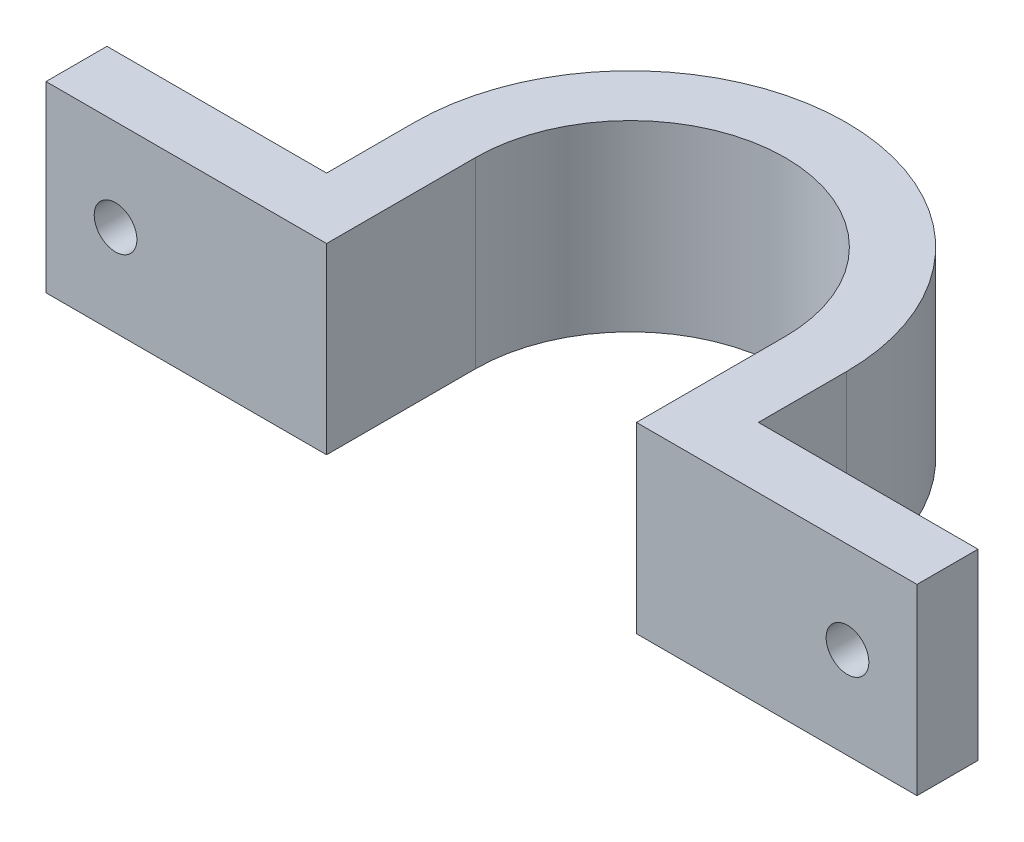
ISO-10303-21;
HEADER;
FILE_DESCRIPTION(('STEP AP214'),'2;1');
FILE_NAME('part.step','',(''),(''),'','','');
FILE_SCHEMA(('AUTOMOTIVE_DESIGN { 1 0 10303 214 1 1 1 1 }'));
ENDSEC;
DATA;
#1=APPLICATION_CONTEXT('core data for automotive mechanical design processes');
#2=APPLICATION_PROTOCOL_DEFINITION('international standard','automotive_design',2000,#1);
#3=PRODUCT_CONTEXT('',#1,'mechanical');
#4=PRODUCT('Part','Part','',(#3));
#5=PRODUCT_RELATED_PRODUCT_CATEGORY('part','',(#4));
#6=PRODUCT_DEFINITION_FORMATION('','',#4);
#7=PRODUCT_DEFINITION_CONTEXT('part definition',#1,'design');
#8=PRODUCT_DEFINITION('design','',#6,#7);
#9=PRODUCT_DEFINITION_SHAPE('','',#8);
#10=(LENGTH_UNIT() NAMED_UNIT(*) SI_UNIT(.MILLI.,.METRE.));
#11=(NAMED_UNIT(*) PLANE_ANGLE_UNIT() SI_UNIT($,.RADIAN.));
#12=(NAMED_UNIT(*) SI_UNIT($,.STERADIAN.) SOLID_ANGLE_UNIT());
#13=UNCERTAINTY_MEASURE_WITH_UNIT(LENGTH_MEASURE(1.E-05),#10,'distance_accuracy_value','');
#14=(GEOMETRIC_REPRESENTATION_CONTEXT(3) GLOBAL_UNCERTAINTY_ASSIGNED_CONTEXT((#13)) GLOBAL_UNIT_ASSIGNED_CONTEXT((#10,
#11,#12)) REPRESENTATION_CONTEXT('',''));
#15=CARTESIAN_POINT('',(0.,0.,0.));
#16=DIRECTION('',(0.,0.,1.));
#17=DIRECTION('',(1.,0.,0.));
#18=AXIS2_PLACEMENT_3D('',#15,#16,#17);
#19=CARTESIAN_POINT('',(17.7,15.,7.19999999999999));
#20=DIRECTION('',(0.,0.,1.));
#21=DIRECTION('',(1.,0.,0.));
#22=AXIS2_PLACEMENT_3D('',#19,#20,#21);
#23=PLANE('',#22);
#24=CARTESIAN_POINT('',(30.,7.5,7.19999999999999));
#25=DIRECTION('',(0.,0.,-1.));
#26=DIRECTION('',(-1.,0.,0.));
#27=AXIS2_PLACEMENT_3D('',#24,#25,#26);
#28=CIRCLE('',#27,1.75);
#29=CARTESIAN_POINT('',(28.25,7.5,7.19999999999999));
#30=VERTEX_POINT('',#29);
#31=EDGE_CURVE('E271',#30,#30,#28,.T.);
#32=ORIENTED_EDGE('',*,*,#31,.F.);
#33=EDGE_LOOP('',(#32));
#34=FACE_BOUND('',#33,.T.);
#35=DIRECTION('',(-1.,0.,0.));
#36=VECTOR('',#35,1.);
#37=CARTESIAN_POINT('',(17.7,0.,7.19999999999999));
#38=LINE('',#37,#36);
#39=CARTESIAN_POINT('',(35.7,0.,7.2));
#40=VERTEX_POINT('',#39);
#41=CARTESIAN_POINT('',(17.7,0.,7.19999999999999));
#42=VERTEX_POINT('',#41);
#43=EDGE_CURVE('E159',#40,#42,#38,.T.);
#44=ORIENTED_EDGE('',*,*,#43,.T.);
#45=DIRECTION('',(0.,-1.,0.));
#46=VECTOR('',#45,1.);
#47=CARTESIAN_POINT('',(17.7,15.,7.19999999999999));
#48=LINE('',#47,#46);
#49=CARTESIAN_POINT('',(17.7,15.,7.19999999999999));
#50=VERTEX_POINT('',#49);
#51=EDGE_CURVE('E11',#50,#42,#48,.T.);
#52=ORIENTED_EDGE('',*,*,#51,.F.);
#53=DIRECTION('',(-1.,0.,0.));
#54=VECTOR('',#53,1.);
#55=CARTESIAN_POINT('',(17.7,15.,7.19999999999999));
#56=LINE('',#55,#54);
#57=CARTESIAN_POINT('',(35.7,15.,7.2));
#58=VERTEX_POINT('',#57);
#59=EDGE_CURVE('E182',#58,#50,#56,.T.);
#60=ORIENTED_EDGE('',*,*,#59,.F.);
#61=DIRECTION('',(0.,-1.,0.));
#62=VECTOR('',#61,1.);
#63=CARTESIAN_POINT('',(35.7,15.,7.2));
#64=LINE('',#63,#62);
#65=EDGE_CURVE('E155',#58,#40,#64,.T.);
#66=ORIENTED_EDGE('',*,*,#65,.T.);
#67=EDGE_LOOP('',(#44,#52,#60,#66));
#68=FACE_BOUND('',#67,.T.);
#69=ADVANCED_FACE('F39',(#34,#68),#23,.F.);
#70=CARTESIAN_POINT('',(17.7,15.,0.));
#71=DIRECTION('',(-1.,0.,0.));
#72=DIRECTION('',(0.,0.,1.));
#73=AXIS2_PLACEMENT_3D('',#70,#71,#72);
#74=PLANE('',#73);
#75=DIRECTION('',(0.,0.,-1.));
#76=VECTOR('',#75,1.);
#77=CARTESIAN_POINT('',(17.7,0.,0.));
#78=LINE('',#77,#76);
#79=CARTESIAN_POINT('',(17.7,0.,0.));
#80=VERTEX_POINT('',#79);
#81=EDGE_CURVE('E162',#42,#80,#78,.T.);
#82=ORIENTED_EDGE('',*,*,#81,.T.);
#83=DIRECTION('',(0.,-1.,0.));
#84=VECTOR('',#83,1.);
#85=CARTESIAN_POINT('',(17.7,15.,0.));
#86=LINE('',#85,#84);
#87=CARTESIAN_POINT('',(17.7,15.,0.));
#88=VERTEX_POINT('',#87);
#89=EDGE_CURVE('E47',#88,#80,#86,.T.);
#90=ORIENTED_EDGE('',*,*,#89,.F.);
#91=DIRECTION('',(0.,0.,-1.));
#92=VECTOR('',#91,1.);
#93=CARTESIAN_POINT('',(17.7,15.,0.));
#94=LINE('',#93,#92);
#95=EDGE_CURVE('E110',#50,#88,#94,.T.);
#96=ORIENTED_EDGE('',*,*,#95,.F.);
#97=ORIENTED_EDGE('',*,*,#51,.T.);
#98=EDGE_LOOP('',(#82,#90,#96,#97));
#99=FACE_BOUND('',#98,.T.);
#100=ADVANCED_FACE('F262',(#99),#74,.F.);
#101=CARTESIAN_POINT('',(0.,15.,0.));
#102=DIRECTION('',(0.,-1.,0.));
#103=DIRECTION('',(0.,0.,-1.));
#104=AXIS2_PLACEMENT_3D('',#101,#102,#103);
#105=CYLINDRICAL_SURFACE('',#104,17.7);
#106=CARTESIAN_POINT('',(0.,0.,0.));
#107=DIRECTION('',(0.,1.,0.));
#108=DIRECTION('',(0.,0.,1.));
#109=AXIS2_PLACEMENT_3D('',#106,#107,#108);
#110=CIRCLE('',#109,17.7);
#111=CARTESIAN_POINT('',(-17.7,0.,0.));
#112=VERTEX_POINT('',#111);
#113=EDGE_CURVE('E165',#80,#112,#110,.T.);
#114=ORIENTED_EDGE('',*,*,#113,.T.);
#115=DIRECTION('',(0.,-1.,0.));
#116=VECTOR('',#115,1.);
#117=CARTESIAN_POINT('',(-17.7,15.,0.));
#118=LINE('',#117,#116);
#119=CARTESIAN_POINT('',(-17.7,15.,0.));
#120=VERTEX_POINT('',#119);
#121=EDGE_CURVE('E201',#120,#112,#118,.T.);
#122=ORIENTED_EDGE('',*,*,#121,.F.);
#123=CARTESIAN_POINT('',(0.,15.,0.));
#124=DIRECTION('',(0.,1.,0.));
#125=DIRECTION('',(0.,0.,1.));
#126=AXIS2_PLACEMENT_3D('',#123,#124,#125);
#127=CIRCLE('',#126,17.7);
#128=EDGE_CURVE('E209',#88,#120,#127,.T.);
#129=ORIENTED_EDGE('',*,*,#128,.F.);
#130=ORIENTED_EDGE('',*,*,#89,.T.);
#131=EDGE_LOOP('',(#114,#122,#129,#130));
#132=FACE_BOUND('',#131,.T.);
#133=ADVANCED_FACE('F207',(#132),#105,.T.);
#134=CARTESIAN_POINT('',(-17.7,15.,0.));
#135=DIRECTION('',(1.,0.,0.));
#136=DIRECTION('',(0.,0.,-1.));
#137=AXIS2_PLACEMENT_3D('',#134,#135,#136);
#138=PLANE('',#137);
#139=DIRECTION('',(0.,0.,1.));
#140=VECTOR('',#139,1.);
#141=CARTESIAN_POINT('',(-17.7,0.,0.));
#142=LINE('',#141,#140);
#143=CARTESIAN_POINT('',(-17.7,0.,7.19999999999999));
#144=VERTEX_POINT('',#143);
#145=EDGE_CURVE('E167',#112,#144,#142,.T.);
#146=ORIENTED_EDGE('',*,*,#145,.T.);
#147=DIRECTION('',(0.,-1.,0.));
#148=VECTOR('',#147,1.);
#149=CARTESIAN_POINT('',(-17.7,15.,7.19999999999999));
#150=LINE('',#149,#148);
#151=CARTESIAN_POINT('',(-17.7,15.,7.19999999999999));
#152=VERTEX_POINT('',#151);
#153=EDGE_CURVE('E198',#152,#144,#150,.T.);
#154=ORIENTED_EDGE('',*,*,#153,.F.);
#155=DIRECTION('',(0.,0.,1.));
#156=VECTOR('',#155,1.);
#157=CARTESIAN_POINT('',(-17.7,15.,0.));
#158=LINE('',#157,#156);
#159=EDGE_CURVE('E227',#120,#152,#158,.T.);
#160=ORIENTED_EDGE('',*,*,#159,.F.);
#161=ORIENTED_EDGE('',*,*,#121,.T.);
#162=EDGE_LOOP('',(#146,#154,#160,#161));
#163=FACE_BOUND('',#162,.T.);
#164=ADVANCED_FACE('F218',(#163),#138,.F.);
#165=CARTESIAN_POINT('',(-17.7,15.,7.19999999999999));
#166=DIRECTION('',(0.,0.,1.));
#167=DIRECTION('',(1.,0.,0.));
#168=AXIS2_PLACEMENT_3D('',#165,#166,#167);
#169=PLANE('',#168);
#170=CARTESIAN_POINT('',(-30.,7.5,7.19999999999999));
#171=DIRECTION('',(0.,0.,-1.));
#172=DIRECTION('',(-1.,0.,0.));
#173=AXIS2_PLACEMENT_3D('',#170,#171,#172);
#174=CIRCLE('',#173,1.75);
#175=CARTESIAN_POINT('',(-31.75,7.5,7.19999999999999));
#176=VERTEX_POINT('',#175);
#177=EDGE_CURVE('E273',#176,#176,#174,.T.);
#178=ORIENTED_EDGE('',*,*,#177,.F.);
#179=EDGE_LOOP('',(#178));
#180=FACE_BOUND('',#179,.T.);
#181=DIRECTION('',(-1.,0.,0.));
#182=VECTOR('',#181,1.);
#183=CARTESIAN_POINT('',(-17.7,0.,7.19999999999999));
#184=LINE('',#183,#182);
#185=CARTESIAN_POINT('',(-35.7,0.,7.2));
#186=VERTEX_POINT('',#185);
#187=EDGE_CURVE('E169',#144,#186,#184,.T.);
#188=ORIENTED_EDGE('',*,*,#187,.T.);
#189=DIRECTION('',(0.,-1.,0.));
#190=VECTOR('',#189,1.);
#191=CARTESIAN_POINT('',(-35.7,15.,7.2));
#192=LINE('',#191,#190);
#193=CARTESIAN_POINT('',(-35.7,15.,7.2));
#194=VERTEX_POINT('',#193);
#195=EDGE_CURVE('E195',#194,#186,#192,.T.);
#196=ORIENTED_EDGE('',*,*,#195,.F.);
#197=DIRECTION('',(-1.,0.,0.));
#198=VECTOR('',#197,1.);
#199=CARTESIAN_POINT('',(-17.7,15.,7.19999999999999));
#200=LINE('',#199,#198);
#201=EDGE_CURVE('E224',#152,#194,#200,.T.);
#202=ORIENTED_EDGE('',*,*,#201,.F.);
#203=ORIENTED_EDGE('',*,*,#153,.T.);
#204=EDGE_LOOP('',(#188,#196,#202,#203));
#205=FACE_BOUND('',#204,.T.);
#206=ADVANCED_FACE('F222',(#180,#205),#169,.F.);
#207=CARTESIAN_POINT('',(-35.7,15.,7.2));
#208=DIRECTION('',(1.,0.,0.));
#209=DIRECTION('',(0.,0.,-1.));
#210=AXIS2_PLACEMENT_3D('',#207,#208,#209);
#211=PLANE('',#210);
#212=DIRECTION('',(0.,0.,1.));
#213=VECTOR('',#212,1.);
#214=CARTESIAN_POINT('',(-35.7,0.,7.2));
#215=LINE('',#214,#213);
#216=CARTESIAN_POINT('',(-35.7,0.,12.2));
#217=VERTEX_POINT('',#216);
#218=EDGE_CURVE('E171',#186,#217,#215,.T.);
#219=ORIENTED_EDGE('',*,*,#218,.T.);
#220=DIRECTION('',(0.,-1.,0.));
#221=VECTOR('',#220,1.);
#222=CARTESIAN_POINT('',(-35.7,15.,12.2));
#223=LINE('',#222,#221);
#224=CARTESIAN_POINT('',(-35.7,15.,12.2));
#225=VERTEX_POINT('',#224);
#226=EDGE_CURVE('E192',#225,#217,#223,.T.);
#227=ORIENTED_EDGE('',*,*,#226,.F.);
#228=DIRECTION('',(0.,0.,1.));
#229=VECTOR('',#228,1.);
#230=CARTESIAN_POINT('',(-35.7,15.,7.2));
#231=LINE('',#230,#229);
#232=EDGE_CURVE('E226',#194,#225,#231,.T.);
#233=ORIENTED_EDGE('',*,*,#232,.F.);
#234=ORIENTED_EDGE('',*,*,#195,.T.);
#235=EDGE_LOOP('',(#219,#227,#233,#234));
#236=FACE_BOUND('',#235,.T.);
#237=ADVANCED_FACE('F296',(#236),#211,.F.);
#238=CARTESIAN_POINT('',(-35.7,15.,12.2));
#239=DIRECTION('',(0.,0.,-1.));
#240=DIRECTION('',(-1.,0.,0.));
#241=AXIS2_PLACEMENT_3D('',#238,#239,#240);
#242=PLANE('',#241);
#243=CARTESIAN_POINT('',(-30.,7.5,12.2));
#244=DIRECTION('',(0.,0.,-1.));
#245=DIRECTION('',(-1.,0.,0.));
#246=AXIS2_PLACEMENT_3D('',#243,#244,#245);
#247=CIRCLE('',#246,1.75);
#248=CARTESIAN_POINT('',(-31.75,7.5,12.2));
#249=VERTEX_POINT('',#248);
#250=EDGE_CURVE('E278',#249,#249,#247,.T.);
#251=ORIENTED_EDGE('',*,*,#250,.T.);
#252=EDGE_LOOP('',(#251));
#253=FACE_BOUND('',#252,.T.);
#254=DIRECTION('',(1.,0.,0.));
#255=VECTOR('',#254,1.);
#256=CARTESIAN_POINT('',(-35.7,0.,12.2));
#257=LINE('',#256,#255);
#258=CARTESIAN_POINT('',(-12.7,0.,12.2));
#259=VERTEX_POINT('',#258);
#260=EDGE_CURVE('E173',#217,#259,#257,.T.);
#261=ORIENTED_EDGE('',*,*,#260,.T.);
#262=DIRECTION('',(0.,-1.,0.));
#263=VECTOR('',#262,1.);
#264=CARTESIAN_POINT('',(-12.7,15.,12.2));
#265=LINE('',#264,#263);
#266=CARTESIAN_POINT('',(-12.7,15.,12.2));
#267=VERTEX_POINT('',#266);
#268=EDGE_CURVE('E189',#267,#259,#265,.T.);
#269=ORIENTED_EDGE('',*,*,#268,.F.);
#270=DIRECTION('',(1.,0.,0.));
#271=VECTOR('',#270,1.);
#272=CARTESIAN_POINT('',(-35.7,15.,12.2));
#273=LINE('',#272,#271);
#274=EDGE_CURVE('E229',#225,#267,#273,.T.);
#275=ORIENTED_EDGE('',*,*,#274,.F.);
#276=ORIENTED_EDGE('',*,*,#226,.T.);
#277=EDGE_LOOP('',(#261,#269,#275,#276));
#278=FACE_BOUND('',#277,.T.);
#279=ADVANCED_FACE('F286',(#253,#278),#242,.F.);
#280=CARTESIAN_POINT('',(-12.7,15.,12.2));
#281=DIRECTION('',(-1.,0.,0.));
#282=DIRECTION('',(0.,0.,1.));
#283=AXIS2_PLACEMENT_3D('',#280,#281,#282);
#284=PLANE('',#283);
#285=DIRECTION('',(0.,0.,-1.));
#286=VECTOR('',#285,1.);
#287=CARTESIAN_POINT('',(-12.7,0.,12.2));
#288=LINE('',#287,#286);
#289=CARTESIAN_POINT('',(-12.7,0.,0.));
#290=VERTEX_POINT('',#289);
#291=EDGE_CURVE('E175',#259,#290,#288,.T.);
#292=ORIENTED_EDGE('',*,*,#291,.T.);
#293=DIRECTION('',(0.,-1.,0.));
#294=VECTOR('',#293,1.);
#295=CARTESIAN_POINT('',(-12.7,15.,0.));
#296=LINE('',#295,#294);
#297=CARTESIAN_POINT('',(-12.7,15.,0.));
#298=VERTEX_POINT('',#297);
#299=EDGE_CURVE('E186',#298,#290,#296,.T.);
#300=ORIENTED_EDGE('',*,*,#299,.F.);
#301=DIRECTION('',(0.,0.,-1.));
#302=VECTOR('',#301,1.);
#303=CARTESIAN_POINT('',(-12.7,15.,12.2));
#304=LINE('',#303,#302);
#305=EDGE_CURVE('E235',#267,#298,#304,.T.);
#306=ORIENTED_EDGE('',*,*,#305,.F.);
#307=ORIENTED_EDGE('',*,*,#268,.T.);
#308=EDGE_LOOP('',(#292,#300,#306,#307));
#309=FACE_BOUND('',#308,.T.);
#310=ADVANCED_FACE('F241',(#309),#284,.F.);
#311=CARTESIAN_POINT('',(0.,15.,0.));
#312=DIRECTION('',(0.,-1.,0.));
#313=DIRECTION('',(0.,0.,-1.));
#314=AXIS2_PLACEMENT_3D('',#311,#312,#313);
#315=CYLINDRICAL_SURFACE('',#314,12.7);
#316=CARTESIAN_POINT('',(0.,0.,0.));
#317=DIRECTION('',(0.,-1.,0.));
#318=DIRECTION('',(0.,0.,-1.));
#319=AXIS2_PLACEMENT_3D('',#316,#317,#318);
#320=CIRCLE('',#319,12.7);
#321=CARTESIAN_POINT('',(12.7,0.,0.));
#322=VERTEX_POINT('',#321);
#323=EDGE_CURVE('E177',#290,#322,#320,.T.);
#324=ORIENTED_EDGE('',*,*,#323,.T.);
#325=DIRECTION('',(0.,-1.,0.));
#326=VECTOR('',#325,1.);
#327=CARTESIAN_POINT('',(12.7,15.,0.));
#328=LINE('',#327,#326);
#329=CARTESIAN_POINT('',(12.7,15.,0.));
#330=VERTEX_POINT('',#329);
#331=EDGE_CURVE('E150',#330,#322,#328,.T.);
#332=ORIENTED_EDGE('',*,*,#331,.F.);
#333=CARTESIAN_POINT('',(0.,15.,0.));
#334=DIRECTION('',(0.,-1.,0.));
#335=DIRECTION('',(0.,0.,-1.));
#336=AXIS2_PLACEMENT_3D('',#333,#334,#335);
#337=CIRCLE('',#336,12.7);
#338=EDGE_CURVE('E141',#298,#330,#337,.T.);
#339=ORIENTED_EDGE('',*,*,#338,.F.);
#340=ORIENTED_EDGE('',*,*,#299,.T.);
#341=EDGE_LOOP('',(#324,#332,#339,#340));
#342=FACE_BOUND('',#341,.T.);
#343=ADVANCED_FACE('F245',(#342),#315,.F.);
#344=CARTESIAN_POINT('',(12.7,15.,12.2));
#345=DIRECTION('',(1.,0.,0.));
#346=DIRECTION('',(0.,0.,-1.));
#347=AXIS2_PLACEMENT_3D('',#344,#345,#346);
#348=PLANE('',#347);
#349=DIRECTION('',(0.,0.,1.));
#350=VECTOR('',#349,1.);
#351=CARTESIAN_POINT('',(12.7,0.,12.2));
#352=LINE('',#351,#350);
#353=CARTESIAN_POINT('',(12.7,0.,12.2));
#354=VERTEX_POINT('',#353);
#355=EDGE_CURVE('E149',#322,#354,#352,.T.);
#356=ORIENTED_EDGE('',*,*,#355,.T.);
#357=DIRECTION('',(0.,-1.,0.));
#358=VECTOR('',#357,1.);
#359=CARTESIAN_POINT('',(12.7,15.,12.2));
#360=LINE('',#359,#358);
#361=CARTESIAN_POINT('',(12.7,15.,12.2));
#362=VERTEX_POINT('',#361);
#363=EDGE_CURVE('E146',#362,#354,#360,.T.);
#364=ORIENTED_EDGE('',*,*,#363,.F.);
#365=DIRECTION('',(0.,0.,1.));
#366=VECTOR('',#365,1.);
#367=CARTESIAN_POINT('',(12.7,15.,12.2));
#368=LINE('',#367,#366);
#369=EDGE_CURVE('E135',#330,#362,#368,.T.);
#370=ORIENTED_EDGE('',*,*,#369,.F.);
#371=ORIENTED_EDGE('',*,*,#331,.T.);
#372=EDGE_LOOP('',(#356,#364,#370,#371));
#373=FACE_BOUND('',#372,.T.);
#374=ADVANCED_FACE('F147',(#373),#348,.F.);
#375=CARTESIAN_POINT('',(35.7,15.,12.2));
#376=DIRECTION('',(0.,0.,-1.));
#377=DIRECTION('',(-1.,0.,0.));
#378=AXIS2_PLACEMENT_3D('',#375,#376,#377);
#379=PLANE('',#378);
#380=CARTESIAN_POINT('',(30.,7.5,12.2));
#381=DIRECTION('',(0.,0.,-1.));
#382=DIRECTION('',(-1.,0.,0.));
#383=AXIS2_PLACEMENT_3D('',#380,#381,#382);
#384=CIRCLE('',#383,1.75);
#385=CARTESIAN_POINT('',(28.25,7.5,12.2));
#386=VERTEX_POINT('',#385);
#387=EDGE_CURVE('E163',#386,#386,#384,.T.);
#388=ORIENTED_EDGE('',*,*,#387,.T.);
#389=EDGE_LOOP('',(#388));
#390=FACE_BOUND('',#389,.T.);
#391=DIRECTION('',(1.,0.,0.));
#392=VECTOR('',#391,1.);
#393=CARTESIAN_POINT('',(35.7,0.,12.2));
#394=LINE('',#393,#392);
#395=CARTESIAN_POINT('',(35.7,0.,12.2));
#396=VERTEX_POINT('',#395);
#397=EDGE_CURVE('E96',#354,#396,#394,.T.);
#398=ORIENTED_EDGE('',*,*,#397,.T.);
#399=DIRECTION('',(0.,-1.,0.));
#400=VECTOR('',#399,1.);
#401=CARTESIAN_POINT('',(35.7,15.,12.2));
#402=LINE('',#401,#400);
#403=CARTESIAN_POINT('',(35.7,15.,12.2));
#404=VERTEX_POINT('',#403);
#405=EDGE_CURVE('E151',#404,#396,#402,.T.);
#406=ORIENTED_EDGE('',*,*,#405,.F.);
#407=DIRECTION('',(1.,0.,0.));
#408=VECTOR('',#407,1.);
#409=CARTESIAN_POINT('',(35.7,15.,12.2));
#410=LINE('',#409,#408);
#411=EDGE_CURVE('E139',#362,#404,#410,.T.);
#412=ORIENTED_EDGE('',*,*,#411,.F.);
#413=ORIENTED_EDGE('',*,*,#363,.T.);
#414=EDGE_LOOP('',(#398,#406,#412,#413));
#415=FACE_BOUND('',#414,.T.);
#416=ADVANCED_FACE('F153',(#390,#415),#379,.F.);
#417=CARTESIAN_POINT('',(35.7,15.,7.2));
#418=DIRECTION('',(-1.,0.,0.));
#419=DIRECTION('',(0.,0.,1.));
#420=AXIS2_PLACEMENT_3D('',#417,#418,#419);
#421=PLANE('',#420);
#422=DIRECTION('',(0.,0.,-1.));
#423=VECTOR('',#422,1.);
#424=CARTESIAN_POINT('',(35.7,0.,7.2));
#425=LINE('',#424,#423);
#426=EDGE_CURVE('E102',#396,#40,#425,.T.);
#427=ORIENTED_EDGE('',*,*,#426,.T.);
#428=ORIENTED_EDGE('',*,*,#65,.F.);
#429=DIRECTION('',(0.,0.,-1.));
#430=VECTOR('',#429,1.);
#431=CARTESIAN_POINT('',(35.7,15.,7.2));
#432=LINE('',#431,#430);
#433=EDGE_CURVE('E55',#404,#58,#432,.T.);
#434=ORIENTED_EDGE('',*,*,#433,.F.);
#435=ORIENTED_EDGE('',*,*,#405,.T.);
#436=EDGE_LOOP('',(#427,#428,#434,#435));
#437=FACE_BOUND('',#436,.T.);
#438=ADVANCED_FACE('F249',(#437),#421,.F.);
#439=CARTESIAN_POINT('',(0.,15.,0.));
#440=DIRECTION('',(0.,-1.,0.));
#441=DIRECTION('',(0.,0.,-1.));
#442=AXIS2_PLACEMENT_3D('',#439,#440,#441);
#443=PLANE('',#442);
#444=ORIENTED_EDGE('',*,*,#59,.T.);
#445=ORIENTED_EDGE('',*,*,#95,.T.);
#446=ORIENTED_EDGE('',*,*,#128,.T.);
#447=ORIENTED_EDGE('',*,*,#159,.T.);
#448=ORIENTED_EDGE('',*,*,#201,.T.);
#449=ORIENTED_EDGE('',*,*,#232,.T.);
#450=ORIENTED_EDGE('',*,*,#274,.T.);
#451=ORIENTED_EDGE('',*,*,#305,.T.);
#452=ORIENTED_EDGE('',*,*,#338,.T.);
#453=ORIENTED_EDGE('',*,*,#369,.T.);
#454=ORIENTED_EDGE('',*,*,#411,.T.);
#455=ORIENTED_EDGE('',*,*,#433,.T.);
#456=EDGE_LOOP('',(#444,#445,#446,#447,#448,#449,#450,#451,#452,#453,#454,#455));
#457=FACE_BOUND('',#456,.T.);
#458=ADVANCED_FACE('F137',(#457),#443,.F.);
#459=CARTESIAN_POINT('',(0.,0.,0.));
#460=DIRECTION('',(0.,-1.,0.));
#461=DIRECTION('',(0.,0.,-1.));
#462=AXIS2_PLACEMENT_3D('',#459,#460,#461);
#463=PLANE('',#462);
#464=ORIENTED_EDGE('',*,*,#43,.F.);
#465=ORIENTED_EDGE('',*,*,#426,.F.);
#466=ORIENTED_EDGE('',*,*,#397,.F.);
#467=ORIENTED_EDGE('',*,*,#355,.F.);
#468=ORIENTED_EDGE('',*,*,#323,.F.);
#469=ORIENTED_EDGE('',*,*,#291,.F.);
#470=ORIENTED_EDGE('',*,*,#260,.F.);
#471=ORIENTED_EDGE('',*,*,#218,.F.);
#472=ORIENTED_EDGE('',*,*,#187,.F.);
#473=ORIENTED_EDGE('',*,*,#145,.F.);
#474=ORIENTED_EDGE('',*,*,#113,.F.);
#475=ORIENTED_EDGE('',*,*,#81,.F.);
#476=EDGE_LOOP('',(#464,#465,#466,#467,#468,#469,#470,#471,#472,#473,#474,#475));
#477=FACE_BOUND('',#476,.T.);
#478=ADVANCED_FACE('F213',(#477),#463,.T.);
#479=CARTESIAN_POINT('',(30.,7.5,12.2));
#480=DIRECTION('',(0.,0.,-1.));
#481=DIRECTION('',(-1.,0.,0.));
#482=AXIS2_PLACEMENT_3D('',#479,#480,#481);
#483=CYLINDRICAL_SURFACE('',#482,1.75);
#484=ORIENTED_EDGE('',*,*,#387,.F.);
#485=EDGE_LOOP('',(#484));
#486=FACE_BOUND('',#485,.T.);
#487=ORIENTED_EDGE('',*,*,#31,.T.);
#488=EDGE_LOOP('',(#487));
#489=FACE_BOUND('',#488,.T.);
#490=ADVANCED_FACE('F292',(#486,#489),#483,.F.);
#491=CARTESIAN_POINT('',(-30.,7.5,12.2));
#492=DIRECTION('',(0.,0.,-1.));
#493=DIRECTION('',(-1.,0.,0.));
#494=AXIS2_PLACEMENT_3D('',#491,#492,#493);
#495=CYLINDRICAL_SURFACE('',#494,1.75);
#496=ORIENTED_EDGE('',*,*,#250,.F.);
#497=EDGE_LOOP('',(#496));
#498=FACE_BOUND('',#497,.T.);
#499=ORIENTED_EDGE('',*,*,#177,.T.);
#500=EDGE_LOOP('',(#499));
#501=FACE_BOUND('',#500,.T.);
#502=ADVANCED_FACE('F289',(#498,#501),#495,.F.);
#503=CLOSED_SHELL('',(#69,#100,#133,#164,#206,#237,#279,#310,#343,#374,#416,#438,#458,#478,#490,#502));
#504=MANIFOLD_SOLID_BREP('B2',#503);
#505=ADVANCED_BREP_SHAPE_REPRESENTATION('',(#18,#504),#14);
#506=SHAPE_DEFINITION_REPRESENTATION(#9,#505);
ENDSEC;
END-ISO-10303-21;
